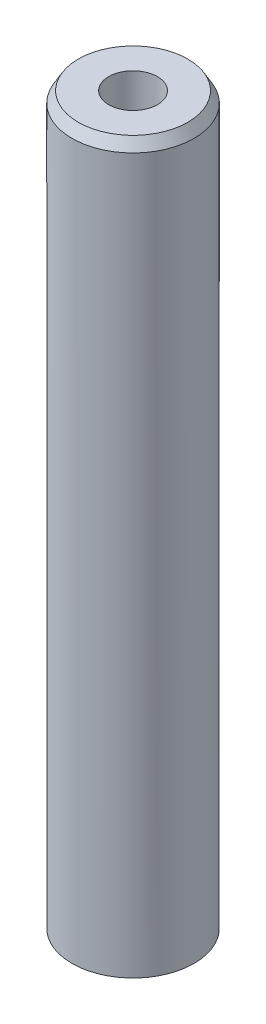
ISO-10303-21;
HEADER;
FILE_DESCRIPTION(('STEP AP214'),'2;1');
FILE_NAME('part.step','',(''),(''),'','','');
FILE_SCHEMA(('AUTOMOTIVE_DESIGN { 1 0 10303 214 1 1 1 1 }'));
ENDSEC;
DATA;
#1=APPLICATION_CONTEXT('core data for automotive mechanical design processes');
#2=APPLICATION_PROTOCOL_DEFINITION('international standard','automotive_design',2000,#1);
#3=PRODUCT_CONTEXT('',#1,'mechanical');
#4=PRODUCT('Part','Part','',(#3));
#5=PRODUCT_RELATED_PRODUCT_CATEGORY('part','',(#4));
#6=PRODUCT_DEFINITION_FORMATION('','',#4);
#7=PRODUCT_DEFINITION_CONTEXT('part definition',#1,'design');
#8=PRODUCT_DEFINITION('design','',#6,#7);
#9=PRODUCT_DEFINITION_SHAPE('','',#8);
#10=(LENGTH_UNIT() NAMED_UNIT(*) SI_UNIT(.MILLI.,.METRE.));
#11=(NAMED_UNIT(*) PLANE_ANGLE_UNIT() SI_UNIT($,.RADIAN.));
#12=(NAMED_UNIT(*) SI_UNIT($,.STERADIAN.) SOLID_ANGLE_UNIT());
#13=UNCERTAINTY_MEASURE_WITH_UNIT(LENGTH_MEASURE(1.E-05),#10,'distance_accuracy_value','');
#14=(GEOMETRIC_REPRESENTATION_CONTEXT(3) GLOBAL_UNCERTAINTY_ASSIGNED_CONTEXT((#13)) GLOBAL_UNIT_ASSIGNED_CONTEXT((#10,
#11,#12)) REPRESENTATION_CONTEXT('',''));
#15=CARTESIAN_POINT('',(0.,0.,0.));
#16=DIRECTION('',(0.,0.,1.));
#17=DIRECTION('',(1.,0.,0.));
#18=AXIS2_PLACEMENT_3D('',#15,#16,#17);
#19=CARTESIAN_POINT('',(0.,359.631004556293,0.));
#20=DIRECTION('',(0.,-1.,0.));
#21=DIRECTION('',(0.,0.,-1.));
#22=AXIS2_PLACEMENT_3D('',#19,#20,#21);
#23=CYLINDRICAL_SURFACE('',#22,30.);
#24=CARTESIAN_POINT('',(0.,354.299842263751,0.));
#25=DIRECTION('',(0.,1.,0.));
#26=DIRECTION('',(0.,0.,1.));
#27=AXIS2_PLACEMENT_3D('',#24,#25,#26);
#28=CIRCLE('',#27,30.);
#29=CARTESIAN_POINT('',(0.,354.299842263751,-30.));
#30=VERTEX_POINT('',#29);
#31=EDGE_CURVE('E50',#30,#30,#28,.F.);
#32=CARTESIAN_POINT('',(0.,3.07794798469335,0.));
#33=DIRECTION('',(0.,1.,0.));
#34=DIRECTION('',(0.,0.,1.));
#35=AXIS2_PLACEMENT_3D('',#32,#33,#34);
#36=CIRCLE('',#35,30.);
#37=CARTESIAN_POINT('',(0.,3.0779479846933,-30.));
#38=VERTEX_POINT('',#37);
#39=EDGE_CURVE('E51',#38,#38,#36,.T.);
#40=CARTESIAN_POINT('',(0.,354.299842263751,-30.));
#41=CARTESIAN_POINT('',(0.,350.64128086501,-30.));
#42=CARTESIAN_POINT('',(0.,346.98271946627,-30.));
#43=CARTESIAN_POINT('',(0.,339.66559666879,-30.));
#44=CARTESIAN_POINT('',(0.,336.00703527005,-30.));
#45=CARTESIAN_POINT('',(0.,328.689912472569,-30.));
#46=CARTESIAN_POINT('',(0.,325.031351073829,-30.));
#47=CARTESIAN_POINT('',(0.,317.714228276349,-30.));
#48=CARTESIAN_POINT('',(0.,314.055666877609,-30.));
#49=CARTESIAN_POINT('',(0.,306.738544080128,-30.));
#50=CARTESIAN_POINT('',(0.,303.079982681388,-30.));
#51=CARTESIAN_POINT('',(0.,295.762859883908,-30.));
#52=CARTESIAN_POINT('',(0.,292.104298485167,-30.));
#53=CARTESIAN_POINT('',(0.,284.787175687687,-30.));
#54=CARTESIAN_POINT('',(0.,281.128614288947,-30.));
#55=CARTESIAN_POINT('',(0.,273.811491491467,-30.));
#56=CARTESIAN_POINT('',(0.,270.152930092726,-30.));
#57=CARTESIAN_POINT('',(0.,262.835807295246,-30.));
#58=CARTESIAN_POINT('',(0.,259.177245896506,-30.));
#59=CARTESIAN_POINT('',(0.,251.860123099026,-30.));
#60=CARTESIAN_POINT('',(0.,248.201561700285,-30.));
#61=CARTESIAN_POINT('',(0.,240.884438902805,-30.));
#62=CARTESIAN_POINT('',(0.,237.225877504065,-30.));
#63=CARTESIAN_POINT('',(0.,229.908754706584,-30.));
#64=CARTESIAN_POINT('',(0.,226.250193307844,-30.));
#65=CARTESIAN_POINT('',(0.,218.933070510364,-30.));
#66=CARTESIAN_POINT('',(0.,215.274509111624,-30.));
#67=CARTESIAN_POINT('',(0.,207.957386314143,-30.));
#68=CARTESIAN_POINT('',(0.,204.298824915403,-30.));
#69=CARTESIAN_POINT('',(0.,196.981702117923,-30.));
#70=CARTESIAN_POINT('',(0.,193.323140719183,-30.));
#71=CARTESIAN_POINT('',(0.,186.006017921702,-30.));
#72=CARTESIAN_POINT('',(0.,182.347456522962,-30.));
#73=CARTESIAN_POINT('',(0.,175.030333725482,-30.));
#74=CARTESIAN_POINT('',(0.,171.371772326742,-30.));
#75=CARTESIAN_POINT('',(0.,164.054649529261,-30.));
#76=CARTESIAN_POINT('',(0.,160.396088130521,-30.));
#77=CARTESIAN_POINT('',(0.,153.078965333041,-30.));
#78=CARTESIAN_POINT('',(0.,149.4204039343,-30.));
#79=CARTESIAN_POINT('',(0.,142.10328113682,-30.));
#80=CARTESIAN_POINT('',(0.,138.44471973808,-30.));
#81=CARTESIAN_POINT('',(0.,131.1275969406,-30.));
#82=CARTESIAN_POINT('',(0.,127.469035541859,-30.));
#83=CARTESIAN_POINT('',(0.,120.151912744379,-30.));
#84=CARTESIAN_POINT('',(0.,116.493351345639,-30.));
#85=CARTESIAN_POINT('',(0.,109.176228548159,-30.));
#86=CARTESIAN_POINT('',(0.,105.517667149418,-30.));
#87=CARTESIAN_POINT('',(0.,98.200544351938,-30.));
#88=CARTESIAN_POINT('',(0.,94.5419829531978,-30.));
#89=CARTESIAN_POINT('',(0.,87.2248601557174,-30.));
#90=CARTESIAN_POINT('',(0.,83.5662987569773,-30.));
#91=CARTESIAN_POINT('',(0.,76.2491759594969,-30.));
#92=CARTESIAN_POINT('',(0.,72.5906145607567,-30.));
#93=CARTESIAN_POINT('',(0.,65.2734917632764,-30.));
#94=CARTESIAN_POINT('',(0.,61.6149303645362,-30.));
#95=CARTESIAN_POINT('',(0.,54.2978075670558,-30.));
#96=CARTESIAN_POINT('',(0.,50.6392461683156,-30.));
#97=CARTESIAN_POINT('',(0.,43.3221233708353,-30.));
#98=CARTESIAN_POINT('',(0.,39.6635619720951,-30.));
#99=CARTESIAN_POINT('',(0.,32.3464391746147,-30.));
#100=CARTESIAN_POINT('',(0.,28.6878777758745,-30.));
#101=CARTESIAN_POINT('',(0.,21.3707549783942,-30.));
#102=CARTESIAN_POINT('',(0.,17.712193579654,-30.));
#103=CARTESIAN_POINT('',(0.,10.3950707821736,-30.));
#104=CARTESIAN_POINT('',(0.,6.73650938343347,-30.));
#105=CARTESIAN_POINT('',(0.,3.0779479846933,-30.));
#106=B_SPLINE_CURVE_WITH_KNOTS('',3,(#40,#41,#42,#43,#44,#45,#46,#47,#48,#49,#50,#51,#52,#53,
#54,#55,#56,#57,#58,#59,#60,#61,#62,#63,#64,#65,#66,#67,#68,#69,#70,#71,#72,#73,#74,#75,#76,#77,
#78,#79,#80,#81,#82,#83,#84,#85,#86,#87,#88,#89,#90,#91,#92,#93,#94,#95,#96,#97,#98,#99,#100,
#101,#102,#103,#104,#105),.UNSPECIFIED.,.F.,.F.,(4,2,2,2,2,2,2,2,2,2,2,2,2,2,2,2,2,2,2,2,2,2,2,
2,2,2,2,2,2,2,2,2,4),(0.,10.9756841962205,21.9513683924411,32.9270525886616,43.9027367848821,
54.8784209811027,65.8541051773232,76.8297893735437,87.8054735697643,98.7811577659848,
109.756841962205,120.732526158426,131.708210354646,142.683894550867,153.659578747087,
164.635262943308,175.610947139529,186.586631335749,197.56231553197,208.53799972819,
219.513683924411,230.489368120631,241.465052316852,252.440736513072,263.416420709293,
274.392104905513,285.367789101734,296.343473297955,307.319157494175,318.294841690396,
329.270525886616,340.246210082837,351.221894279057),.UNSPECIFIED.);
#107=EDGE_CURVE('BSEAM39',#30,#38,#106,.T.);
#108=ORIENTED_EDGE('',*,*,#31,.T.);
#109=ORIENTED_EDGE('',*,*,#39,.T.);
#110=ORIENTED_EDGE('',*,*,#107,.T.);
#111=ORIENTED_EDGE('',*,*,#107,.F.);
#112=EDGE_LOOP('',(#108,#110,#109,#111));
#113=FACE_BOUND('',#112,.T.);
#114=ADVANCED_FACE('F39',(#113),#23,.T.);
#115=CARTESIAN_POINT('',(0.,359.631004556293,0.));
#116=DIRECTION('',(0.,1.,0.));
#117=DIRECTION('',(0.,0.,1.));
#118=AXIS2_PLACEMENT_3D('',#115,#116,#117);
#119=PLANE('',#118);
#120=CARTESIAN_POINT('',(0.,359.631004556293,0.));
#121=DIRECTION('',(0.,1.,0.));
#122=DIRECTION('',(0.,0.,1.));
#123=AXIS2_PLACEMENT_3D('',#120,#121,#122);
#124=CIRCLE('',#123,26.922052015307);
#125=CARTESIAN_POINT('',(0.,359.631004556293,26.922052015307));
#126=VERTEX_POINT('',#125);
#127=EDGE_CURVE('E54',#126,#126,#124,.T.);
#128=ORIENTED_EDGE('',*,*,#127,.T.);
#129=EDGE_LOOP('',(#128));
#130=FACE_BOUND('',#129,.T.);
#131=CARTESIAN_POINT('',(0.,359.631004556293,0.));
#132=DIRECTION('',(0.,1.,0.));
#133=DIRECTION('',(0.,0.,1.));
#134=AXIS2_PLACEMENT_3D('',#131,#132,#133);
#135=CIRCLE('',#134,11.9721259401096);
#136=CARTESIAN_POINT('',(0.,359.631004556293,-11.9721259401096));
#137=VERTEX_POINT('',#136);
#138=EDGE_CURVE('E58',#137,#137,#135,.T.);
#139=ORIENTED_EDGE('',*,*,#138,.F.);
#140=EDGE_LOOP('',(#139));
#141=FACE_BOUND('',#140,.T.);
#142=ADVANCED_FACE('F69',(#130,#141),#119,.T.);
#143=CARTESIAN_POINT('',(0.,0.,0.));
#144=DIRECTION('',(0.,1.,0.));
#145=DIRECTION('',(0.,0.,1.));
#146=AXIS2_PLACEMENT_3D('',#143,#144,#145);
#147=PLANE('',#146);
#148=CARTESIAN_POINT('',(0.,0.,0.));
#149=DIRECTION('',(0.,1.,0.));
#150=DIRECTION('',(0.,0.,1.));
#151=AXIS2_PLACEMENT_3D('',#148,#149,#150);
#152=CIRCLE('',#151,24.6688377074569);
#153=CARTESIAN_POINT('',(0.,0.,24.6688377074569));
#154=VERTEX_POINT('',#153);
#155=EDGE_CURVE('E10',#154,#154,#152,.F.);
#156=ORIENTED_EDGE('',*,*,#155,.T.);
#157=EDGE_LOOP('',(#156));
#158=FACE_BOUND('',#157,.T.);
#159=CARTESIAN_POINT('',(0.,0.,0.));
#160=DIRECTION('',(0.,1.,0.));
#161=DIRECTION('',(0.,0.,1.));
#162=AXIS2_PLACEMENT_3D('',#159,#160,#161);
#163=CIRCLE('',#162,11.9721259401096);
#164=CARTESIAN_POINT('',(0.,0.,-11.9721259401096));
#165=VERTEX_POINT('',#164);
#166=EDGE_CURVE('E63',#165,#165,#163,.T.);
#167=ORIENTED_EDGE('',*,*,#166,.T.);
#168=EDGE_LOOP('',(#167));
#169=FACE_BOUND('',#168,.T.);
#170=ADVANCED_FACE('F75',(#158,#169),#147,.F.);
#171=CARTESIAN_POINT('',(0.,359.631004556293,0.));
#172=DIRECTION('',(0.,-1.,0.));
#173=DIRECTION('',(0.,0.,-1.));
#174=AXIS2_PLACEMENT_3D('',#171,#172,#173);
#175=CYLINDRICAL_SURFACE('',#174,11.9721259401096);
#176=CARTESIAN_POINT('',(0.,359.631004556293,-11.9721259401096));
#177=CARTESIAN_POINT('',(0.,355.884848258832,-11.9721259401096));
#178=CARTESIAN_POINT('',(0.,352.13869196137,-11.9721259401096));
#179=CARTESIAN_POINT('',(0.,344.646379366448,-11.9721259401096));
#180=CARTESIAN_POINT('',(0.,340.900223068986,-11.9721259401096));
#181=CARTESIAN_POINT('',(0.,333.407910474063,-11.9721259401096));
#182=CARTESIAN_POINT('',(0.,329.661754176602,-11.9721259401096));
#183=CARTESIAN_POINT('',(0.,322.169441581679,-11.9721259401096));
#184=CARTESIAN_POINT('',(0.,318.423285284218,-11.9721259401096));
#185=CARTESIAN_POINT('',(0.,310.930972689295,-11.9721259401096));
#186=CARTESIAN_POINT('',(0.,307.184816391834,-11.9721259401096));
#187=CARTESIAN_POINT('',(0.,299.692503796911,-11.9721259401096));
#188=CARTESIAN_POINT('',(0.,295.94634749945,-11.9721259401096));
#189=CARTESIAN_POINT('',(0.,288.454034904527,-11.9721259401096));
#190=CARTESIAN_POINT('',(0.,284.707878607065,-11.9721259401096));
#191=CARTESIAN_POINT('',(0.,277.215566012143,-11.9721259401096));
#192=CARTESIAN_POINT('',(0.,273.469409714681,-11.9721259401096));
#193=CARTESIAN_POINT('',(0.,265.977097119758,-11.9721259401096));
#194=CARTESIAN_POINT('',(0.,262.230940822297,-11.9721259401096));
#195=CARTESIAN_POINT('',(0.,254.738628227374,-11.9721259401096));
#196=CARTESIAN_POINT('',(0.,250.992471929913,-11.9721259401096));
#197=CARTESIAN_POINT('',(0.,243.50015933499,-11.9721259401096));
#198=CARTESIAN_POINT('',(0.,239.754003037529,-11.9721259401096));
#199=CARTESIAN_POINT('',(0.,232.261690442606,-11.9721259401096));
#200=CARTESIAN_POINT('',(0.,228.515534145145,-11.9721259401096));
#201=CARTESIAN_POINT('',(0.,221.023221550222,-11.9721259401096));
#202=CARTESIAN_POINT('',(0.,217.27706525276,-11.9721259401096));
#203=CARTESIAN_POINT('',(0.,209.784752657838,-11.9721259401096));
#204=CARTESIAN_POINT('',(0.,206.038596360376,-11.9721259401096));
#205=CARTESIAN_POINT('',(0.,198.546283765453,-11.9721259401096));
#206=CARTESIAN_POINT('',(0.,194.800127467992,-11.9721259401096));
#207=CARTESIAN_POINT('',(0.,187.307814873069,-11.9721259401096));
#208=CARTESIAN_POINT('',(0.,183.561658575608,-11.9721259401096));
#209=CARTESIAN_POINT('',(0.,176.069345980685,-11.9721259401096));
#210=CARTESIAN_POINT('',(0.,172.323189683224,-11.9721259401096));
#211=CARTESIAN_POINT('',(0.,164.830877088301,-11.9721259401096));
#212=CARTESIAN_POINT('',(0.,161.08472079084,-11.9721259401096));
#213=CARTESIAN_POINT('',(0.,153.592408195917,-11.9721259401096));
#214=CARTESIAN_POINT('',(0.,149.846251898455,-11.9721259401096));
#215=CARTESIAN_POINT('',(0.,142.353939303533,-11.9721259401096));
#216=CARTESIAN_POINT('',(0.,138.607783006071,-11.9721259401096));
#217=CARTESIAN_POINT('',(0.,131.115470411149,-11.9721259401096));
#218=CARTESIAN_POINT('',(0.,127.369314113687,-11.9721259401096));
#219=CARTESIAN_POINT('',(0.,119.877001518764,-11.9721259401096));
#220=CARTESIAN_POINT('',(0.,116.130845221303,-11.9721259401096));
#221=CARTESIAN_POINT('',(0.,108.63853262638,-11.9721259401096));
#222=CARTESIAN_POINT('',(0.,104.892376328919,-11.9721259401096));
#223=CARTESIAN_POINT('',(0.,97.4000637339961,-11.9721259401096));
#224=CARTESIAN_POINT('',(0.,93.6539074365347,-11.9721259401096));
#225=CARTESIAN_POINT('',(0.,86.1615948416119,-11.9721259401096));
#226=CARTESIAN_POINT('',(0.,82.4154385441505,-11.9721259401096));
#227=CARTESIAN_POINT('',(0.,74.9231259492277,-11.9721259401096));
#228=CARTESIAN_POINT('',(0.,71.1769696517663,-11.9721259401096));
#229=CARTESIAN_POINT('',(0.,63.6846570568436,-11.9721259401096));
#230=CARTESIAN_POINT('',(0.,59.9385007593822,-11.9721259401096));
#231=CARTESIAN_POINT('',(0.,52.4461881644594,-11.9721259401096));
#232=CARTESIAN_POINT('',(0.,48.700031866998,-11.9721259401096));
#233=CARTESIAN_POINT('',(0.,41.2077192720752,-11.9721259401096));
#234=CARTESIAN_POINT('',(0.,37.4615629746139,-11.9721259401096));
#235=CARTESIAN_POINT('',(0.,29.9692503796911,-11.9721259401096));
#236=CARTESIAN_POINT('',(0.,26.2230940822297,-11.9721259401096));
#237=CARTESIAN_POINT('',(0.,18.7307814873069,-11.9721259401096));
#238=CARTESIAN_POINT('',(0.,14.9846251898456,-11.9721259401096));
#239=CARTESIAN_POINT('',(0.,7.49231259492278,-11.9721259401096));
#240=CARTESIAN_POINT('',(0.,3.74615629746139,-11.9721259401096));
#241=CARTESIAN_POINT('',(0.,0.,-11.9721259401096));
#242=B_SPLINE_CURVE_WITH_KNOTS('',3,(#176,#177,#178,#179,#180,#181,#182,#183,#184,#185,#186,
#187,#188,#189,#190,#191,#192,#193,#194,#195,#196,#197,#198,#199,#200,#201,#202,#203,#204,#205,
#206,#207,#208,#209,#210,#211,#212,#213,#214,#215,#216,#217,#218,#219,#220,#221,#222,#223,#224,
#225,#226,#227,#228,#229,#230,#231,#232,#233,#234,#235,#236,#237,#238,#239,#240,#241),
.UNSPECIFIED.,.F.,.F.,(4,2,2,2,2,2,2,2,2,2,2,2,2,2,2,2,2,2,2,2,2,2,2,2,2,2,2,2,2,2,2,2,4),(0.,
11.2384688923841,22.4769377847683,33.7154066771525,44.9538755695366,56.1923444619208,
67.4308133543049,78.6692822466891,89.9077511390732,101.146220031457,112.384688923842,
123.623157816226,134.86162670861,146.100095600994,157.338564493378,168.577033385762,
179.815502278146,191.053971170531,202.292440062915,213.530908955299,224.769377847683,
236.007846740067,247.246315632451,258.484784524836,269.72325341722,280.961722309604,
292.200191201988,303.438660094372,314.677128986756,325.915597879141,337.154066771525,
348.392535663909,359.631004556293),.UNSPECIFIED.);
#243=EDGE_CURVE('BSEAM70',#137,#165,#242,.T.);
#244=ORIENTED_EDGE('',*,*,#138,.T.);
#245=ORIENTED_EDGE('',*,*,#166,.F.);
#246=ORIENTED_EDGE('',*,*,#243,.T.);
#247=ORIENTED_EDGE('',*,*,#243,.F.);
#248=EDGE_LOOP('',(#244,#246,#245,#247));
#249=FACE_BOUND('',#248,.T.);
#250=ADVANCED_FACE('F70',(#249),#175,.F.);
#251=CARTESIAN_POINT('',(0.,359.631004556293,0.));
#252=DIRECTION('',(0.,-1.,0.));
#253=DIRECTION('',(0.,0.,-1.));
#254=AXIS2_PLACEMENT_3D('',#251,#252,#253);
#255=CONICAL_SURFACE('',#254,26.922052015307,0.523598775598299);
#256=ORIENTED_EDGE('',*,*,#31,.F.);
#257=EDGE_LOOP('',(#256));
#258=FACE_BOUND('',#257,.T.);
#259=ORIENTED_EDGE('',*,*,#127,.F.);
#260=EDGE_LOOP('',(#259));
#261=FACE_BOUND('',#260,.T.);
#262=ADVANCED_FACE('F81',(#258,#261),#255,.T.);
#263=CARTESIAN_POINT('',(0.,3.0779479846933,0.));
#264=DIRECTION('',(0.,1.,0.));
#265=DIRECTION('',(0.,0.,1.));
#266=AXIS2_PLACEMENT_3D('',#263,#264,#265);
#267=CONICAL_SURFACE('',#266,30.,1.0471975511966);
#268=ORIENTED_EDGE('',*,*,#155,.F.);
#269=EDGE_LOOP('',(#268));
#270=FACE_BOUND('',#269,.T.);
#271=ORIENTED_EDGE('',*,*,#39,.F.);
#272=EDGE_LOOP('',(#271));
#273=FACE_BOUND('',#272,.T.);
#274=ADVANCED_FACE('F45',(#270,#273),#267,.T.);
#275=CLOSED_SHELL('',(#114,#142,#170,#250,#262,#274));
#276=MANIFOLD_SOLID_BREP('B2',#275);
#277=ADVANCED_BREP_SHAPE_REPRESENTATION('',(#18,#276),#14);
#278=SHAPE_DEFINITION_REPRESENTATION(#9,#277);
ENDSEC;
END-ISO-10303-21;
